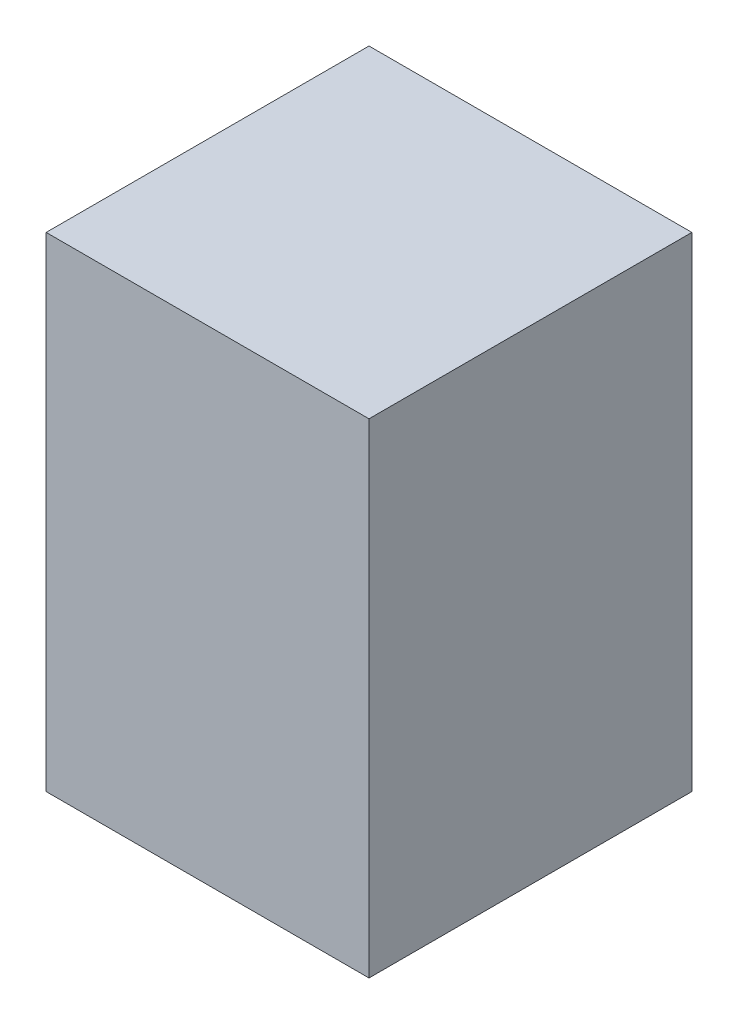
ISO-10303-21;
HEADER;
FILE_DESCRIPTION(('STEP AP214'),'2;1');
FILE_NAME('part.step','',(''),(''),'','','');
FILE_SCHEMA(('AUTOMOTIVE_DESIGN { 1 0 10303 214 1 1 1 1 }'));
ENDSEC;
DATA;
#1=APPLICATION_CONTEXT('core data for automotive mechanical design processes');
#2=APPLICATION_PROTOCOL_DEFINITION('international standard','automotive_design',2000,#1);
#3=PRODUCT_CONTEXT('',#1,'mechanical');
#4=PRODUCT('Part','Part','',(#3));
#5=PRODUCT_RELATED_PRODUCT_CATEGORY('part','',(#4));
#6=PRODUCT_DEFINITION_FORMATION('','',#4);
#7=PRODUCT_DEFINITION_CONTEXT('part definition',#1,'design');
#8=PRODUCT_DEFINITION('design','',#6,#7);
#9=PRODUCT_DEFINITION_SHAPE('','',#8);
#10=(LENGTH_UNIT() NAMED_UNIT(*) SI_UNIT(.MILLI.,.METRE.));
#11=(NAMED_UNIT(*) PLANE_ANGLE_UNIT() SI_UNIT($,.RADIAN.));
#12=(NAMED_UNIT(*) SI_UNIT($,.STERADIAN.) SOLID_ANGLE_UNIT());
#13=UNCERTAINTY_MEASURE_WITH_UNIT(LENGTH_MEASURE(1.E-05),#10,'distance_accuracy_value','');
#14=(GEOMETRIC_REPRESENTATION_CONTEXT(3) GLOBAL_UNCERTAINTY_ASSIGNED_CONTEXT((#13)) GLOBAL_UNIT_ASSIGNED_CONTEXT((#10,
#11,#12)) REPRESENTATION_CONTEXT('',''));
#15=CARTESIAN_POINT('',(0.,0.,0.));
#16=DIRECTION('',(0.,0.,1.));
#17=DIRECTION('',(1.,0.,0.));
#18=AXIS2_PLACEMENT_3D('',#15,#16,#17);
#19=CARTESIAN_POINT('',(-182.562007996033,304.8,-72.4647058823529));
#20=DIRECTION('',(1.,0.,0.));
#21=DIRECTION('',(0.,0.,-1.));
#22=AXIS2_PLACEMENT_3D('',#19,#20,#21);
#23=PLANE('',#22);
#24=DIRECTION('',(0.,0.,1.));
#25=VECTOR('',#24,1.);
#26=CARTESIAN_POINT('',(-182.562007996033,0.,-72.4647058823529));
#27=LINE('',#26,#25);
#28=CARTESIAN_POINT('',(-182.562007996033,0.,-72.4647058823529));
#29=VERTEX_POINT('',#28);
#30=CARTESIAN_POINT('',(-182.562007996033,0.,130.735294117647));
#31=VERTEX_POINT('',#30);
#32=EDGE_CURVE('E102',#29,#31,#27,.T.);
#33=ORIENTED_EDGE('',*,*,#32,.T.);
#34=DIRECTION('',(0.,-1.,0.));
#35=VECTOR('',#34,1.);
#36=CARTESIAN_POINT('',(-182.562007996033,304.8,130.735294117647));
#37=LINE('',#36,#35);
#38=CARTESIAN_POINT('',(-182.562007996033,304.8,130.735294117647));
#39=VERTEX_POINT('',#38);
#40=EDGE_CURVE('E11',#39,#31,#37,.T.);
#41=ORIENTED_EDGE('',*,*,#40,.F.);
#42=DIRECTION('',(0.,0.,1.));
#43=VECTOR('',#42,1.);
#44=CARTESIAN_POINT('',(-182.562007996033,304.8,-72.4647058823529));
#45=LINE('',#44,#43);
#46=CARTESIAN_POINT('',(-182.562007996033,304.8,-72.4647058823529));
#47=VERTEX_POINT('',#46);
#48=EDGE_CURVE('E90',#47,#39,#45,.T.);
#49=ORIENTED_EDGE('',*,*,#48,.F.);
#50=DIRECTION('',(0.,-1.,0.));
#51=VECTOR('',#50,1.);
#52=CARTESIAN_POINT('',(-182.562007996033,304.8,-72.4647058823529));
#53=LINE('',#52,#51);
#54=EDGE_CURVE('E98',#47,#29,#53,.T.);
#55=ORIENTED_EDGE('',*,*,#54,.T.);
#56=EDGE_LOOP('',(#33,#41,#49,#55));
#57=FACE_BOUND('',#56,.T.);
#58=ADVANCED_FACE('F39',(#57),#23,.F.);
#59=CARTESIAN_POINT('',(-182.562007996033,304.8,130.735294117647));
#60=DIRECTION('',(0.,0.,-1.));
#61=DIRECTION('',(-1.,0.,0.));
#62=AXIS2_PLACEMENT_3D('',#59,#60,#61);
#63=PLANE('',#62);
#64=DIRECTION('',(1.,0.,0.));
#65=VECTOR('',#64,1.);
#66=CARTESIAN_POINT('',(-182.562007996033,0.,130.735294117647));
#67=LINE('',#66,#65);
#68=CARTESIAN_POINT('',(20.6379920039669,0.,130.735294117647));
#69=VERTEX_POINT('',#68);
#70=EDGE_CURVE('E94',#31,#69,#67,.T.);
#71=ORIENTED_EDGE('',*,*,#70,.T.);
#72=DIRECTION('',(0.,-1.,0.));
#73=VECTOR('',#72,1.);
#74=CARTESIAN_POINT('',(20.6379920039669,304.8,130.735294117647));
#75=LINE('',#74,#73);
#76=CARTESIAN_POINT('',(20.6379920039669,304.8,130.735294117647));
#77=VERTEX_POINT('',#76);
#78=EDGE_CURVE('E47',#77,#69,#75,.T.);
#79=ORIENTED_EDGE('',*,*,#78,.F.);
#80=DIRECTION('',(1.,0.,0.));
#81=VECTOR('',#80,1.);
#82=CARTESIAN_POINT('',(-182.562007996033,304.8,130.735294117647));
#83=LINE('',#82,#81);
#84=EDGE_CURVE('E85',#39,#77,#83,.T.);
#85=ORIENTED_EDGE('',*,*,#84,.F.);
#86=ORIENTED_EDGE('',*,*,#40,.T.);
#87=EDGE_LOOP('',(#71,#79,#85,#86));
#88=FACE_BOUND('',#87,.T.);
#89=ADVANCED_FACE('F93',(#88),#63,.F.);
#90=CARTESIAN_POINT('',(20.6379920039668,304.8,-72.4647058823529));
#91=DIRECTION('',(-1.,0.,0.));
#92=DIRECTION('',(0.,0.,1.));
#93=AXIS2_PLACEMENT_3D('',#90,#91,#92);
#94=PLANE('',#93);
#95=DIRECTION('',(0.,0.,-1.));
#96=VECTOR('',#95,1.);
#97=CARTESIAN_POINT('',(20.6379920039668,0.,-72.4647058823529));
#98=LINE('',#97,#96);
#99=CARTESIAN_POINT('',(20.6379920039668,0.,-72.4647058823529));
#100=VERTEX_POINT('',#99);
#101=EDGE_CURVE('E72',#69,#100,#98,.T.);
#102=ORIENTED_EDGE('',*,*,#101,.T.);
#103=DIRECTION('',(0.,-1.,0.));
#104=VECTOR('',#103,1.);
#105=CARTESIAN_POINT('',(20.6379920039668,304.8,-72.4647058823529));
#106=LINE('',#105,#104);
#107=CARTESIAN_POINT('',(20.6379920039668,304.8,-72.4647058823529));
#108=VERTEX_POINT('',#107);
#109=EDGE_CURVE('E95',#108,#100,#106,.T.);
#110=ORIENTED_EDGE('',*,*,#109,.F.);
#111=DIRECTION('',(0.,0.,-1.));
#112=VECTOR('',#111,1.);
#113=CARTESIAN_POINT('',(20.6379920039668,304.8,-72.4647058823529));
#114=LINE('',#113,#112);
#115=EDGE_CURVE('E88',#77,#108,#114,.T.);
#116=ORIENTED_EDGE('',*,*,#115,.F.);
#117=ORIENTED_EDGE('',*,*,#78,.T.);
#118=EDGE_LOOP('',(#102,#110,#116,#117));
#119=FACE_BOUND('',#118,.T.);
#120=ADVANCED_FACE('F96',(#119),#94,.F.);
#121=CARTESIAN_POINT('',(-182.562007996033,304.8,-72.4647058823529));
#122=DIRECTION('',(0.,0.,1.));
#123=DIRECTION('',(1.,0.,0.));
#124=AXIS2_PLACEMENT_3D('',#121,#122,#123);
#125=PLANE('',#124);
#126=DIRECTION('',(-1.,0.,0.));
#127=VECTOR('',#126,1.);
#128=CARTESIAN_POINT('',(-182.562007996033,0.,-72.4647058823529));
#129=LINE('',#128,#127);
#130=EDGE_CURVE('E78',#100,#29,#129,.T.);
#131=ORIENTED_EDGE('',*,*,#130,.T.);
#132=ORIENTED_EDGE('',*,*,#54,.F.);
#133=DIRECTION('',(-1.,0.,0.));
#134=VECTOR('',#133,1.);
#135=CARTESIAN_POINT('',(-182.562007996033,304.8,-72.4647058823529));
#136=LINE('',#135,#134);
#137=EDGE_CURVE('E55',#108,#47,#136,.T.);
#138=ORIENTED_EDGE('',*,*,#137,.F.);
#139=ORIENTED_EDGE('',*,*,#109,.T.);
#140=EDGE_LOOP('',(#131,#132,#138,#139));
#141=FACE_BOUND('',#140,.T.);
#142=ADVANCED_FACE('F109',(#141),#125,.F.);
#143=CARTESIAN_POINT('',(0.,304.8,0.));
#144=DIRECTION('',(0.,1.,0.));
#145=DIRECTION('',(0.,0.,1.));
#146=AXIS2_PLACEMENT_3D('',#143,#144,#145);
#147=PLANE('',#146);
#148=ORIENTED_EDGE('',*,*,#48,.T.);
#149=ORIENTED_EDGE('',*,*,#84,.T.);
#150=ORIENTED_EDGE('',*,*,#115,.T.);
#151=ORIENTED_EDGE('',*,*,#137,.T.);
#152=EDGE_LOOP('',(#148,#149,#150,#151));
#153=FACE_BOUND('',#152,.T.);
#154=ADVANCED_FACE('F86',(#153),#147,.T.);
#155=CARTESIAN_POINT('',(0.,0.,0.));
#156=DIRECTION('',(0.,1.,0.));
#157=DIRECTION('',(0.,0.,1.));
#158=AXIS2_PLACEMENT_3D('',#155,#156,#157);
#159=PLANE('',#158);
#160=ORIENTED_EDGE('',*,*,#32,.F.);
#161=ORIENTED_EDGE('',*,*,#130,.F.);
#162=ORIENTED_EDGE('',*,*,#101,.F.);
#163=ORIENTED_EDGE('',*,*,#70,.F.);
#164=EDGE_LOOP('',(#160,#161,#162,#163));
#165=FACE_BOUND('',#164,.T.);
#166=ADVANCED_FACE('F112',(#165),#159,.F.);
#167=CLOSED_SHELL('',(#58,#89,#120,#142,#154,#166));
#168=MANIFOLD_SOLID_BREP('B2',#167);
#169=ADVANCED_BREP_SHAPE_REPRESENTATION('',(#18,#168),#14);
#170=SHAPE_DEFINITION_REPRESENTATION(#9,#169);
ENDSEC;
END-ISO-10303-21;
